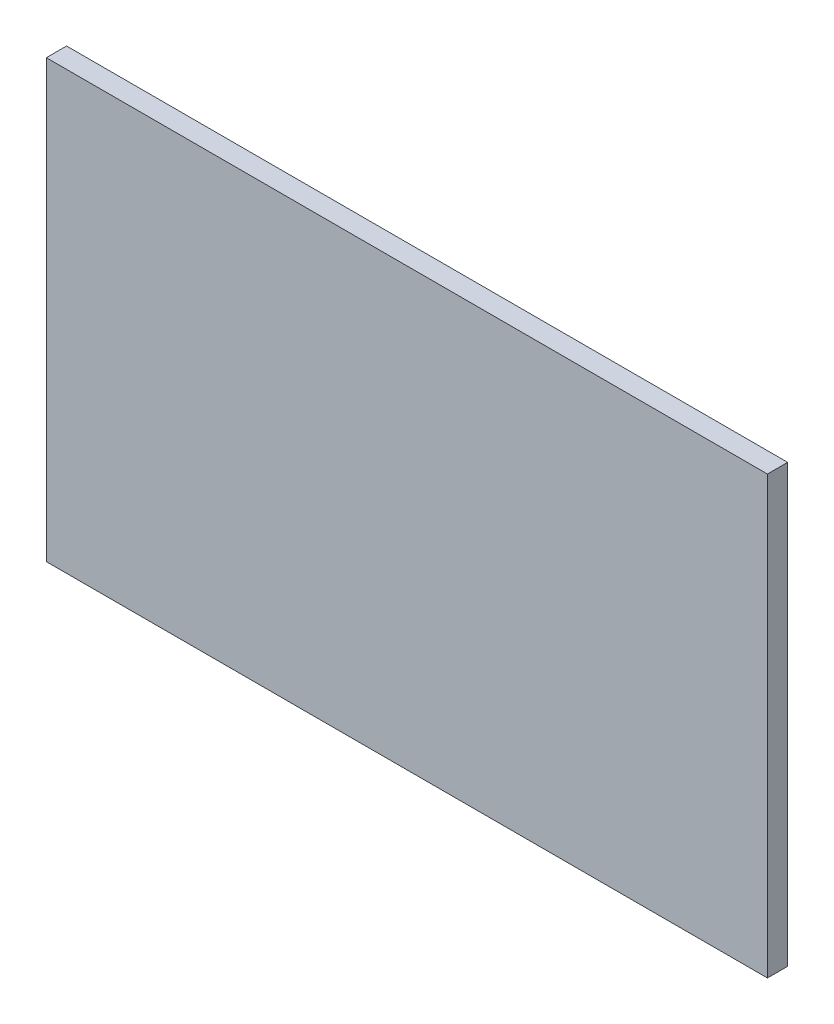
ISO-10303-21;
HEADER;
FILE_DESCRIPTION(('STEP AP214'),'2;1');
FILE_NAME('part.step','',(''),(''),'','','');
FILE_SCHEMA(('AUTOMOTIVE_DESIGN { 1 0 10303 214 1 1 1 1 }'));
ENDSEC;
DATA;
#1=APPLICATION_CONTEXT('core data for automotive mechanical design processes');
#2=APPLICATION_PROTOCOL_DEFINITION('international standard','automotive_design',2000,#1);
#3=PRODUCT_CONTEXT('',#1,'mechanical');
#4=PRODUCT('Part','Part','',(#3));
#5=PRODUCT_RELATED_PRODUCT_CATEGORY('part','',(#4));
#6=PRODUCT_DEFINITION_FORMATION('','',#4);
#7=PRODUCT_DEFINITION_CONTEXT('part definition',#1,'design');
#8=PRODUCT_DEFINITION('design','',#6,#7);
#9=PRODUCT_DEFINITION_SHAPE('','',#8);
#10=(LENGTH_UNIT() NAMED_UNIT(*) SI_UNIT(.MILLI.,.METRE.));
#11=(NAMED_UNIT(*) PLANE_ANGLE_UNIT() SI_UNIT($,.RADIAN.));
#12=(NAMED_UNIT(*) SI_UNIT($,.STERADIAN.) SOLID_ANGLE_UNIT());
#13=UNCERTAINTY_MEASURE_WITH_UNIT(LENGTH_MEASURE(1.E-05),#10,'distance_accuracy_value','');
#14=(GEOMETRIC_REPRESENTATION_CONTEXT(3) GLOBAL_UNCERTAINTY_ASSIGNED_CONTEXT((#13)) GLOBAL_UNIT_ASSIGNED_CONTEXT((#10,
#11,#12)) REPRESENTATION_CONTEXT('',''));
#15=CARTESIAN_POINT('',(0.,0.,0.));
#16=DIRECTION('',(0.,0.,1.));
#17=DIRECTION('',(1.,0.,0.));
#18=AXIS2_PLACEMENT_3D('',#15,#16,#17);
#19=CARTESIAN_POINT('',(-39.9948564570988,55.4948564570988,1.6));
#20=DIRECTION('',(1.,0.,0.));
#21=DIRECTION('',(0.,1.,0.));
#22=AXIS2_PLACEMENT_3D('',#19,#20,#21);
#23=PLANE('',#22);
#24=DIRECTION('',(0.,-1.,0.));
#25=VECTOR('',#24,1.);
#26=CARTESIAN_POINT('',(-39.9948564570988,55.4948564570988,0.));
#27=LINE('',#26,#25);
#28=CARTESIAN_POINT('',(-39.9948564570988,55.4948564570988,0.));
#29=VERTEX_POINT('',#28);
#30=CARTESIAN_POINT('',(-39.9948564570988,20.9948564570988,0.));
#31=VERTEX_POINT('',#30);
#32=EDGE_CURVE('E96',#29,#31,#27,.T.);
#33=ORIENTED_EDGE('',*,*,#32,.T.);
#34=DIRECTION('',(0.,0.,-1.));
#35=VECTOR('',#34,1.);
#36=CARTESIAN_POINT('',(-39.9948564570988,20.9948564570988,1.6));
#37=LINE('',#36,#35);
#38=CARTESIAN_POINT('',(-39.9948564570988,20.9948564570988,1.6));
#39=VERTEX_POINT('',#38);
#40=EDGE_CURVE('E11',#39,#31,#37,.T.);
#41=ORIENTED_EDGE('',*,*,#40,.F.);
#42=DIRECTION('',(0.,-1.,0.));
#43=VECTOR('',#42,1.);
#44=CARTESIAN_POINT('',(-39.9948564570988,55.4948564570988,1.6));
#45=LINE('',#44,#43);
#46=CARTESIAN_POINT('',(-39.9948564570988,55.4948564570988,1.6));
#47=VERTEX_POINT('',#46);
#48=EDGE_CURVE('E84',#47,#39,#45,.T.);
#49=ORIENTED_EDGE('',*,*,#48,.F.);
#50=DIRECTION('',(0.,0.,-1.));
#51=VECTOR('',#50,1.);
#52=CARTESIAN_POINT('',(-39.9948564570988,55.4948564570988,1.6));
#53=LINE('',#52,#51);
#54=EDGE_CURVE('E92',#47,#29,#53,.T.);
#55=ORIENTED_EDGE('',*,*,#54,.T.);
#56=EDGE_LOOP('',(#33,#41,#49,#55));
#57=FACE_BOUND('',#56,.T.);
#58=ADVANCED_FACE('F33',(#57),#23,.F.);
#59=CARTESIAN_POINT('',(-39.9948564570988,20.9948564570988,1.6));
#60=DIRECTION('',(0.,1.,0.));
#61=DIRECTION('',(0.,0.,1.));
#62=AXIS2_PLACEMENT_3D('',#59,#60,#61);
#63=PLANE('',#62);
#64=DIRECTION('',(1.,0.,0.));
#65=VECTOR('',#64,1.);
#66=CARTESIAN_POINT('',(-39.9948564570988,20.9948564570988,0.));
#67=LINE('',#66,#65);
#68=CARTESIAN_POINT('',(17.0051435429012,20.9948564570988,0.));
#69=VERTEX_POINT('',#68);
#70=EDGE_CURVE('E88',#31,#69,#67,.T.);
#71=ORIENTED_EDGE('',*,*,#70,.T.);
#72=DIRECTION('',(0.,0.,-1.));
#73=VECTOR('',#72,1.);
#74=CARTESIAN_POINT('',(17.0051435429012,20.9948564570988,1.6));
#75=LINE('',#74,#73);
#76=CARTESIAN_POINT('',(17.0051435429012,20.9948564570988,1.6));
#77=VERTEX_POINT('',#76);
#78=EDGE_CURVE('E41',#77,#69,#75,.T.);
#79=ORIENTED_EDGE('',*,*,#78,.F.);
#80=DIRECTION('',(1.,0.,0.));
#81=VECTOR('',#80,1.);
#82=CARTESIAN_POINT('',(-39.9948564570988,20.9948564570988,1.6));
#83=LINE('',#82,#81);
#84=EDGE_CURVE('E79',#39,#77,#83,.T.);
#85=ORIENTED_EDGE('',*,*,#84,.F.);
#86=ORIENTED_EDGE('',*,*,#40,.T.);
#87=EDGE_LOOP('',(#71,#79,#85,#86));
#88=FACE_BOUND('',#87,.T.);
#89=ADVANCED_FACE('F87',(#88),#63,.F.);
#90=CARTESIAN_POINT('',(17.0051435429012,55.4948564570988,1.6));
#91=DIRECTION('',(-1.,0.,0.));
#92=DIRECTION('',(0.,-1.,0.));
#93=AXIS2_PLACEMENT_3D('',#90,#91,#92);
#94=PLANE('',#93);
#95=DIRECTION('',(0.,1.,0.));
#96=VECTOR('',#95,1.);
#97=CARTESIAN_POINT('',(17.0051435429012,55.4948564570988,0.));
#98=LINE('',#97,#96);
#99=CARTESIAN_POINT('',(17.0051435429012,55.4948564570988,0.));
#100=VERTEX_POINT('',#99);
#101=EDGE_CURVE('E66',#69,#100,#98,.T.);
#102=ORIENTED_EDGE('',*,*,#101,.T.);
#103=DIRECTION('',(0.,0.,-1.));
#104=VECTOR('',#103,1.);
#105=CARTESIAN_POINT('',(17.0051435429012,55.4948564570988,1.6));
#106=LINE('',#105,#104);
#107=CARTESIAN_POINT('',(17.0051435429012,55.4948564570988,1.6));
#108=VERTEX_POINT('',#107);
#109=EDGE_CURVE('E89',#108,#100,#106,.T.);
#110=ORIENTED_EDGE('',*,*,#109,.F.);
#111=DIRECTION('',(0.,1.,0.));
#112=VECTOR('',#111,1.);
#113=CARTESIAN_POINT('',(17.0051435429012,55.4948564570988,1.6));
#114=LINE('',#113,#112);
#115=EDGE_CURVE('E82',#77,#108,#114,.T.);
#116=ORIENTED_EDGE('',*,*,#115,.F.);
#117=ORIENTED_EDGE('',*,*,#78,.T.);
#118=EDGE_LOOP('',(#102,#110,#116,#117));
#119=FACE_BOUND('',#118,.T.);
#120=ADVANCED_FACE('F90',(#119),#94,.F.);
#121=CARTESIAN_POINT('',(-39.9948564570988,55.4948564570988,1.6));
#122=DIRECTION('',(0.,-1.,0.));
#123=DIRECTION('',(0.,0.,-1.));
#124=AXIS2_PLACEMENT_3D('',#121,#122,#123);
#125=PLANE('',#124);
#126=DIRECTION('',(-1.,0.,0.));
#127=VECTOR('',#126,1.);
#128=CARTESIAN_POINT('',(-39.9948564570988,55.4948564570988,0.));
#129=LINE('',#128,#127);
#130=EDGE_CURVE('E72',#100,#29,#129,.T.);
#131=ORIENTED_EDGE('',*,*,#130,.T.);
#132=ORIENTED_EDGE('',*,*,#54,.F.);
#133=DIRECTION('',(-1.,0.,0.));
#134=VECTOR('',#133,1.);
#135=CARTESIAN_POINT('',(-39.9948564570988,55.4948564570988,1.6));
#136=LINE('',#135,#134);
#137=EDGE_CURVE('E49',#108,#47,#136,.T.);
#138=ORIENTED_EDGE('',*,*,#137,.F.);
#139=ORIENTED_EDGE('',*,*,#109,.T.);
#140=EDGE_LOOP('',(#131,#132,#138,#139));
#141=FACE_BOUND('',#140,.T.);
#142=ADVANCED_FACE('F103',(#141),#125,.F.);
#143=CARTESIAN_POINT('',(0.,0.,1.6));
#144=DIRECTION('',(0.,0.,1.));
#145=DIRECTION('',(1.,0.,0.));
#146=AXIS2_PLACEMENT_3D('',#143,#144,#145);
#147=PLANE('',#146);
#148=ORIENTED_EDGE('',*,*,#48,.T.);
#149=ORIENTED_EDGE('',*,*,#84,.T.);
#150=ORIENTED_EDGE('',*,*,#115,.T.);
#151=ORIENTED_EDGE('',*,*,#137,.T.);
#152=EDGE_LOOP('',(#148,#149,#150,#151));
#153=FACE_BOUND('',#152,.T.);
#154=ADVANCED_FACE('F80',(#153),#147,.T.);
#155=CARTESIAN_POINT('',(0.,0.,0.));
#156=DIRECTION('',(0.,0.,1.));
#157=DIRECTION('',(1.,0.,0.));
#158=AXIS2_PLACEMENT_3D('',#155,#156,#157);
#159=PLANE('',#158);
#160=ORIENTED_EDGE('',*,*,#32,.F.);
#161=ORIENTED_EDGE('',*,*,#130,.F.);
#162=ORIENTED_EDGE('',*,*,#101,.F.);
#163=ORIENTED_EDGE('',*,*,#70,.F.);
#164=EDGE_LOOP('',(#160,#161,#162,#163));
#165=FACE_BOUND('',#164,.T.);
#166=ADVANCED_FACE('F106',(#165),#159,.F.);
#167=CLOSED_SHELL('',(#58,#89,#120,#142,#154,#166));
#168=MANIFOLD_SOLID_BREP('B2',#167);
#169=ADVANCED_BREP_SHAPE_REPRESENTATION('',(#18,#168),#14);
#170=SHAPE_DEFINITION_REPRESENTATION(#9,#169);
ENDSEC;
END-ISO-10303-21;
